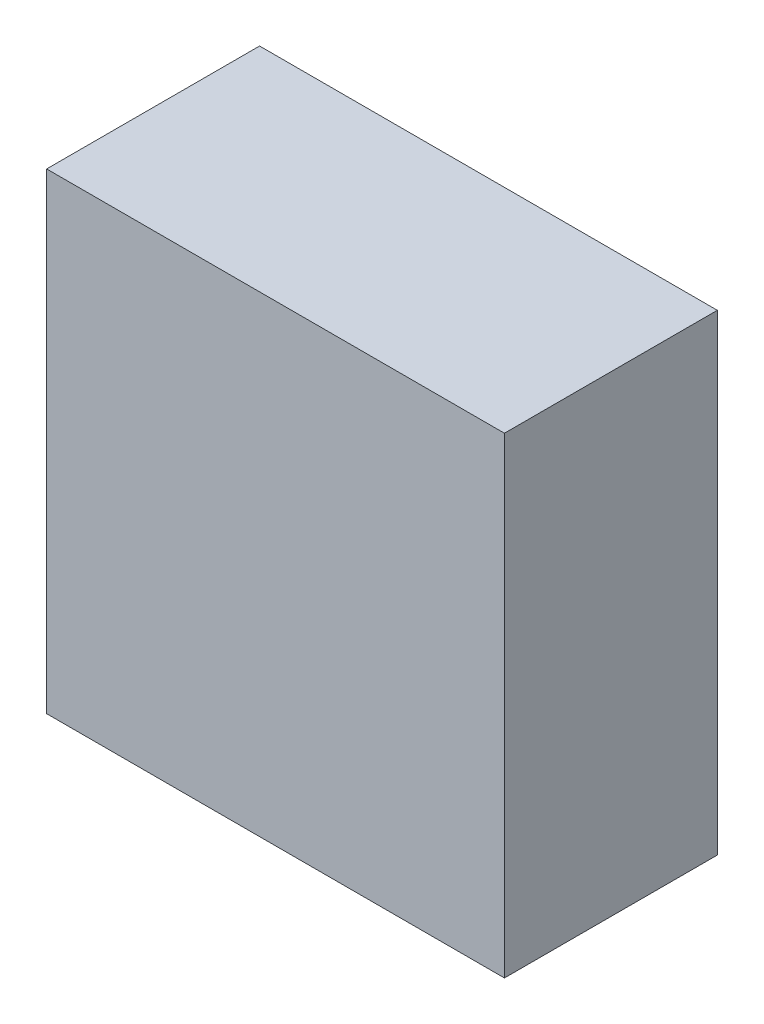
ISO-10303-21;
HEADER;
FILE_DESCRIPTION(('STEP AP214'),'2;1');
FILE_NAME('part.step','',(''),(''),'','','');
FILE_SCHEMA(('AUTOMOTIVE_DESIGN { 1 0 10303 214 1 1 1 1 }'));
ENDSEC;
DATA;
#1=APPLICATION_CONTEXT('core data for automotive mechanical design processes');
#2=APPLICATION_PROTOCOL_DEFINITION('international standard','automotive_design',2000,#1);
#3=PRODUCT_CONTEXT('',#1,'mechanical');
#4=PRODUCT('Part','Part','',(#3));
#5=PRODUCT_RELATED_PRODUCT_CATEGORY('part','',(#4));
#6=PRODUCT_DEFINITION_FORMATION('','',#4);
#7=PRODUCT_DEFINITION_CONTEXT('part definition',#1,'design');
#8=PRODUCT_DEFINITION('design','',#6,#7);
#9=PRODUCT_DEFINITION_SHAPE('','',#8);
#10=(LENGTH_UNIT() NAMED_UNIT(*) SI_UNIT(.MILLI.,.METRE.));
#11=(NAMED_UNIT(*) PLANE_ANGLE_UNIT() SI_UNIT($,.RADIAN.));
#12=(NAMED_UNIT(*) SI_UNIT($,.STERADIAN.) SOLID_ANGLE_UNIT());
#13=UNCERTAINTY_MEASURE_WITH_UNIT(LENGTH_MEASURE(1.E-05),#10,'distance_accuracy_value','');
#14=(GEOMETRIC_REPRESENTATION_CONTEXT(3) GLOBAL_UNCERTAINTY_ASSIGNED_CONTEXT((#13)) GLOBAL_UNIT_ASSIGNED_CONTEXT((#10,
#11,#12)) REPRESENTATION_CONTEXT('',''));
#15=CARTESIAN_POINT('',(0.,0.,0.));
#16=DIRECTION('',(0.,0.,1.));
#17=DIRECTION('',(1.,0.,0.));
#18=AXIS2_PLACEMENT_3D('',#15,#16,#17);
#19=CARTESIAN_POINT('',(-0.53749956,0.553974,0.499999));
#20=DIRECTION('',(0.,0.,1.));
#21=DIRECTION('',(1.,0.,0.));
#22=AXIS2_PLACEMENT_3D('',#19,#20,#21);
#23=PLANE('',#22);
#24=DIRECTION('',(0.,1.,0.));
#25=VECTOR('',#24,1.);
#26=CARTESIAN_POINT('',(0.53749956,0.553974,0.499999));
#27=LINE('',#26,#25);
#28=CARTESIAN_POINT('',(0.53749956,0.553974,0.499999));
#29=VERTEX_POINT('',#28);
#30=CARTESIAN_POINT('',(0.53749956,-0.553974,0.499999));
#31=VERTEX_POINT('',#30);
#32=EDGE_CURVE('E53',#29,#31,#27,.F.);
#33=ORIENTED_EDGE('',*,*,#32,.F.);
#34=DIRECTION('',(1.,0.,0.));
#35=VECTOR('',#34,1.);
#36=CARTESIAN_POINT('',(-0.53749956,0.553974,0.499999));
#37=LINE('',#36,#35);
#38=CARTESIAN_POINT('',(-0.53749956,0.553974,0.499999));
#39=VERTEX_POINT('',#38);
#40=EDGE_CURVE('E68',#39,#29,#37,.T.);
#41=ORIENTED_EDGE('',*,*,#40,.F.);
#42=DIRECTION('',(0.,1.,0.));
#43=VECTOR('',#42,1.);
#44=CARTESIAN_POINT('',(-0.53749956,-0.553974,0.499999));
#45=LINE('',#44,#43);
#46=CARTESIAN_POINT('',(-0.53749956,-0.553974,0.499999));
#47=VERTEX_POINT('',#46);
#48=EDGE_CURVE('E20',#47,#39,#45,.T.);
#49=ORIENTED_EDGE('',*,*,#48,.F.);
#50=DIRECTION('',(1.,0.,0.));
#51=VECTOR('',#50,1.);
#52=CARTESIAN_POINT('',(0.53749956,-0.553974,0.499999));
#53=LINE('',#52,#51);
#54=EDGE_CURVE('E58',#31,#47,#53,.F.);
#55=ORIENTED_EDGE('',*,*,#54,.F.);
#56=EDGE_LOOP('',(#33,#41,#49,#55));
#57=FACE_BOUND('',#56,.T.);
#58=ADVANCED_FACE('F17',(#57),#23,.T.);
#59=CARTESIAN_POINT('',(-0.53749956,-0.553974,0.));
#60=DIRECTION('',(-1.,0.,0.));
#61=DIRECTION('',(0.,0.,1.));
#62=AXIS2_PLACEMENT_3D('',#59,#60,#61);
#63=PLANE('',#62);
#64=DIRECTION('',(0.,0.,1.));
#65=VECTOR('',#64,1.);
#66=CARTESIAN_POINT('',(-0.53749956,0.553974,0.));
#67=LINE('',#66,#65);
#68=CARTESIAN_POINT('',(-0.53749956,0.553974,0.));
#69=VERTEX_POINT('',#68);
#70=EDGE_CURVE('E79',#69,#39,#67,.T.);
#71=ORIENTED_EDGE('',*,*,#70,.F.);
#72=DIRECTION('',(0.,1.,0.));
#73=VECTOR('',#72,1.);
#74=CARTESIAN_POINT('',(-0.53749956,0.553974,0.));
#75=LINE('',#74,#73);
#76=CARTESIAN_POINT('',(-0.53749956,-0.553974,0.));
#77=VERTEX_POINT('',#76);
#78=EDGE_CURVE('E74',#69,#77,#75,.F.);
#79=ORIENTED_EDGE('',*,*,#78,.T.);
#80=DIRECTION('',(0.,0.,-1.));
#81=VECTOR('',#80,1.);
#82=CARTESIAN_POINT('',(-0.53749956,-0.553974,0.));
#83=LINE('',#82,#81);
#84=EDGE_CURVE('E63',#47,#77,#83,.T.);
#85=ORIENTED_EDGE('',*,*,#84,.F.);
#86=ORIENTED_EDGE('',*,*,#48,.T.);
#87=EDGE_LOOP('',(#71,#79,#85,#86));
#88=FACE_BOUND('',#87,.T.);
#89=ADVANCED_FACE('F73',(#88),#63,.T.);
#90=CARTESIAN_POINT('',(0.53749956,-0.553974,0.));
#91=DIRECTION('',(0.,-1.,0.));
#92=DIRECTION('',(0.,0.,-1.));
#93=AXIS2_PLACEMENT_3D('',#90,#91,#92);
#94=PLANE('',#93);
#95=ORIENTED_EDGE('',*,*,#84,.T.);
#96=DIRECTION('',(1.,0.,0.));
#97=VECTOR('',#96,1.);
#98=CARTESIAN_POINT('',(-0.53749956,-0.553974,0.));
#99=LINE('',#98,#97);
#100=CARTESIAN_POINT('',(0.53749956,-0.553974,0.));
#101=VERTEX_POINT('',#100);
#102=EDGE_CURVE('E84',#77,#101,#99,.T.);
#103=ORIENTED_EDGE('',*,*,#102,.T.);
#104=DIRECTION('',(0.,0.,-1.));
#105=VECTOR('',#104,1.);
#106=CARTESIAN_POINT('',(0.53749956,-0.553974,0.));
#107=LINE('',#106,#105);
#108=EDGE_CURVE('E65',#31,#101,#107,.T.);
#109=ORIENTED_EDGE('',*,*,#108,.F.);
#110=ORIENTED_EDGE('',*,*,#54,.T.);
#111=EDGE_LOOP('',(#95,#103,#109,#110));
#112=FACE_BOUND('',#111,.T.);
#113=ADVANCED_FACE('F60',(#112),#94,.T.);
#114=CARTESIAN_POINT('',(0.53749956,0.553974,0.));
#115=DIRECTION('',(1.,0.,0.));
#116=DIRECTION('',(0.,0.,-1.));
#117=AXIS2_PLACEMENT_3D('',#114,#115,#116);
#118=PLANE('',#117);
#119=ORIENTED_EDGE('',*,*,#108,.T.);
#120=DIRECTION('',(0.,1.,0.));
#121=VECTOR('',#120,1.);
#122=CARTESIAN_POINT('',(0.53749956,0.553974,0.));
#123=LINE('',#122,#121);
#124=CARTESIAN_POINT('',(0.53749956,0.553974,0.));
#125=VERTEX_POINT('',#124);
#126=EDGE_CURVE('E26',#101,#125,#123,.T.);
#127=ORIENTED_EDGE('',*,*,#126,.T.);
#128=DIRECTION('',(0.,0.,1.));
#129=VECTOR('',#128,1.);
#130=CARTESIAN_POINT('',(0.53749956,0.553974,0.));
#131=LINE('',#130,#129);
#132=EDGE_CURVE('E34',#29,#125,#131,.F.);
#133=ORIENTED_EDGE('',*,*,#132,.F.);
#134=ORIENTED_EDGE('',*,*,#32,.T.);
#135=EDGE_LOOP('',(#119,#127,#133,#134));
#136=FACE_BOUND('',#135,.T.);
#137=ADVANCED_FACE('F88',(#136),#118,.T.);
#138=CARTESIAN_POINT('',(-0.53749956,0.553974,0.));
#139=DIRECTION('',(0.,1.,0.));
#140=DIRECTION('',(0.,0.,1.));
#141=AXIS2_PLACEMENT_3D('',#138,#139,#140);
#142=PLANE('',#141);
#143=ORIENTED_EDGE('',*,*,#132,.T.);
#144=DIRECTION('',(1.,0.,0.));
#145=VECTOR('',#144,1.);
#146=CARTESIAN_POINT('',(-0.53749956,0.553974,0.));
#147=LINE('',#146,#145);
#148=EDGE_CURVE('E11',#125,#69,#147,.F.);
#149=ORIENTED_EDGE('',*,*,#148,.T.);
#150=ORIENTED_EDGE('',*,*,#70,.T.);
#151=ORIENTED_EDGE('',*,*,#40,.T.);
#152=EDGE_LOOP('',(#143,#149,#150,#151));
#153=FACE_BOUND('',#152,.T.);
#154=ADVANCED_FACE('F91',(#153),#142,.T.);
#155=CARTESIAN_POINT('',(-0.53749956,0.553974,0.));
#156=DIRECTION('',(0.,0.,1.));
#157=DIRECTION('',(1.,0.,0.));
#158=AXIS2_PLACEMENT_3D('',#155,#156,#157);
#159=PLANE('',#158);
#160=ORIENTED_EDGE('',*,*,#126,.F.);
#161=ORIENTED_EDGE('',*,*,#102,.F.);
#162=ORIENTED_EDGE('',*,*,#78,.F.);
#163=ORIENTED_EDGE('',*,*,#148,.F.);
#164=EDGE_LOOP('',(#160,#161,#162,#163));
#165=FACE_BOUND('',#164,.T.);
#166=ADVANCED_FACE('F90',(#165),#159,.F.);
#167=CLOSED_SHELL('',(#58,#89,#113,#137,#154,#166));
#168=MANIFOLD_SOLID_BREP('B1',#167);
#169=ADVANCED_BREP_SHAPE_REPRESENTATION('',(#18,#168),#14);
#170=SHAPE_DEFINITION_REPRESENTATION(#9,#169);
ENDSEC;
END-ISO-10303-21;
